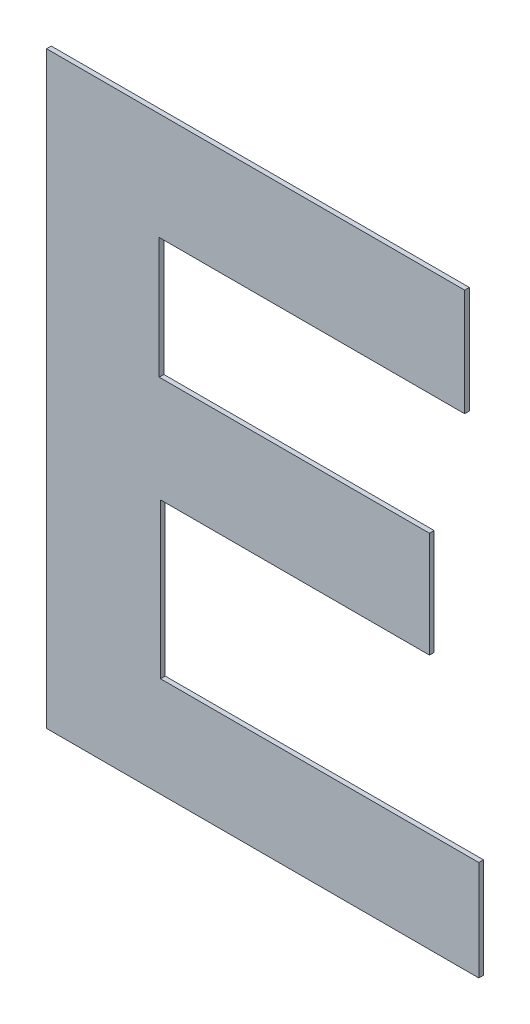
ISO-10303-21;
HEADER;
FILE_DESCRIPTION(('STEP AP214'),'2;1');
FILE_NAME('part.step','',(''),(''),'','','');
FILE_SCHEMA(('AUTOMOTIVE_DESIGN { 1 0 10303 214 1 1 1 1 }'));
ENDSEC;
DATA;
#1=APPLICATION_CONTEXT('core data for automotive mechanical design processes');
#2=APPLICATION_PROTOCOL_DEFINITION('international standard','automotive_design',2000,#1);
#3=PRODUCT_CONTEXT('',#1,'mechanical');
#4=PRODUCT('Part','Part','',(#3));
#5=PRODUCT_RELATED_PRODUCT_CATEGORY('part','',(#4));
#6=PRODUCT_DEFINITION_FORMATION('','',#4);
#7=PRODUCT_DEFINITION_CONTEXT('part definition',#1,'design');
#8=PRODUCT_DEFINITION('design','',#6,#7);
#9=PRODUCT_DEFINITION_SHAPE('','',#8);
#10=(LENGTH_UNIT() NAMED_UNIT(*) SI_UNIT(.MILLI.,.METRE.));
#11=(NAMED_UNIT(*) PLANE_ANGLE_UNIT() SI_UNIT($,.RADIAN.));
#12=(NAMED_UNIT(*) SI_UNIT($,.STERADIAN.) SOLID_ANGLE_UNIT());
#13=UNCERTAINTY_MEASURE_WITH_UNIT(LENGTH_MEASURE(1.E-05),#10,'distance_accuracy_value','');
#14=(GEOMETRIC_REPRESENTATION_CONTEXT(3) GLOBAL_UNCERTAINTY_ASSIGNED_CONTEXT((#13)) GLOBAL_UNIT_ASSIGNED_CONTEXT((#10,
#11,#12)) REPRESENTATION_CONTEXT('',''));
#15=CARTESIAN_POINT('',(0.,0.,0.));
#16=DIRECTION('',(0.,0.,1.));
#17=DIRECTION('',(1.,0.,0.));
#18=AXIS2_PLACEMENT_3D('',#15,#16,#17);
#19=CARTESIAN_POINT('',(-0.2580326955261,-0.078781583834882,0.00086146168299));
#20=DIRECTION('',(-1.,0.,0.));
#21=DIRECTION('',(0.,0.,1.));
#22=AXIS2_PLACEMENT_3D('',#19,#20,#21);
#23=PLANE('',#22);
#24=DIRECTION('',(0.,0.,1.));
#25=VECTOR('',#24,1.);
#26=CARTESIAN_POINT('',(-0.2580326955261,-0.1544312260326,-0.00033853831701));
#27=LINE('',#26,#25);
#28=CARTESIAN_POINT('',(-0.2580326955261,-0.1544312260326,-0.00033853831701));
#29=VERTEX_POINT('',#28);
#30=CARTESIAN_POINT('',(-0.2580326955261,-0.1544312260326,0.00086146168299));
#31=VERTEX_POINT('',#30);
#32=EDGE_CURVE('E11',#29,#31,#27,.T.);
#33=ORIENTED_EDGE('',*,*,#32,.T.);
#34=DIRECTION('',(0.,1.,0.));
#35=VECTOR('',#34,1.);
#36=CARTESIAN_POINT('',(-0.2580326955261,-0.1544312260326,0.00086146168299));
#37=LINE('',#36,#35);
#38=CARTESIAN_POINT('',(-0.2580326955261,-0.00313194163716401,0.00086146168299));
#39=VERTEX_POINT('',#38);
#40=EDGE_CURVE('E24',#31,#39,#37,.T.);
#41=ORIENTED_EDGE('',*,*,#40,.T.);
#42=DIRECTION('',(0.,0.,1.));
#43=VECTOR('',#42,1.);
#44=CARTESIAN_POINT('',(-0.2580326955261,-0.00313194163716401,-0.00033853831701));
#45=LINE('',#44,#43);
#46=CARTESIAN_POINT('',(-0.2580326955261,-0.00313194163716401,-0.00033853831701));
#47=VERTEX_POINT('',#46);
#48=EDGE_CURVE('E197',#47,#39,#45,.T.);
#49=ORIENTED_EDGE('',*,*,#48,.F.);
#50=DIRECTION('',(0.,1.,0.));
#51=VECTOR('',#50,1.);
#52=CARTESIAN_POINT('',(-0.2580326955261,-0.1544312260326,-0.00033853831701));
#53=LINE('',#52,#51);
#54=EDGE_CURVE('E195',#29,#47,#53,.T.);
#55=ORIENTED_EDGE('',*,*,#54,.F.);
#56=EDGE_LOOP('',(#33,#41,#49,#55));
#57=FACE_BOUND('',#56,.T.);
#58=ADVANCED_FACE('F17',(#57),#23,.T.);
#59=CARTESIAN_POINT('',(-0.2042939733141,-0.00313194163716401,0.00086146168299));
#60=DIRECTION('',(0.,1.,0.));
#61=DIRECTION('',(0.,0.,1.));
#62=AXIS2_PLACEMENT_3D('',#59,#60,#61);
#63=PLANE('',#62);
#64=ORIENTED_EDGE('',*,*,#48,.T.);
#65=DIRECTION('',(1.,0.,0.));
#66=VECTOR('',#65,1.);
#67=CARTESIAN_POINT('',(-0.2580326955261,-0.00313194163716401,0.00086146168299));
#68=LINE('',#67,#66);
#69=CARTESIAN_POINT('',(-0.1505552511021,-0.00313194163716401,0.00086146168299));
#70=VERTEX_POINT('',#69);
#71=EDGE_CURVE('E193',#39,#70,#68,.T.);
#72=ORIENTED_EDGE('',*,*,#71,.T.);
#73=DIRECTION('',(0.,0.,1.));
#74=VECTOR('',#73,1.);
#75=CARTESIAN_POINT('',(-0.1505552511021,-0.00313194163716401,-0.00033853831701));
#76=LINE('',#75,#74);
#77=CARTESIAN_POINT('',(-0.1505552511021,-0.00313194163716401,-0.00033853831701));
#78=VERTEX_POINT('',#77);
#79=EDGE_CURVE('E190',#78,#70,#76,.T.);
#80=ORIENTED_EDGE('',*,*,#79,.F.);
#81=DIRECTION('',(1.,0.,0.));
#82=VECTOR('',#81,1.);
#83=CARTESIAN_POINT('',(-0.2580326955261,-0.00313194163716401,-0.00033853831701));
#84=LINE('',#83,#82);
#85=EDGE_CURVE('E187',#47,#78,#84,.T.);
#86=ORIENTED_EDGE('',*,*,#85,.F.);
#87=EDGE_LOOP('',(#64,#72,#80,#86));
#88=FACE_BOUND('',#87,.T.);
#89=ADVANCED_FACE('F203',(#88),#63,.T.);
#90=CARTESIAN_POINT('',(-0.1505552511021,-0.016894632137542,0.00086146168299));
#91=DIRECTION('',(1.,0.,0.));
#92=DIRECTION('',(0.,0.,-1.));
#93=AXIS2_PLACEMENT_3D('',#90,#91,#92);
#94=PLANE('',#93);
#95=ORIENTED_EDGE('',*,*,#79,.T.);
#96=DIRECTION('',(0.,-1.,0.));
#97=VECTOR('',#96,1.);
#98=CARTESIAN_POINT('',(-0.1505552511021,-0.00313194163716401,0.00086146168299));
#99=LINE('',#98,#97);
#100=CARTESIAN_POINT('',(-0.1505552511021,-0.03065732263792,0.00086146168299));
#101=VERTEX_POINT('',#100);
#102=EDGE_CURVE('E185',#70,#101,#99,.T.);
#103=ORIENTED_EDGE('',*,*,#102,.T.);
#104=DIRECTION('',(0.,0.,1.));
#105=VECTOR('',#104,1.);
#106=CARTESIAN_POINT('',(-0.1505552511021,-0.03065732263792,-0.00033853831701));
#107=LINE('',#106,#105);
#108=CARTESIAN_POINT('',(-0.1505552511021,-0.03065732263792,-0.00033853831701));
#109=VERTEX_POINT('',#108);
#110=EDGE_CURVE('E182',#109,#101,#107,.T.);
#111=ORIENTED_EDGE('',*,*,#110,.F.);
#112=DIRECTION('',(0.,-1.,0.));
#113=VECTOR('',#112,1.);
#114=CARTESIAN_POINT('',(-0.1505552511021,-0.00313194163716401,-0.00033853831701));
#115=LINE('',#114,#113);
#116=EDGE_CURVE('E179',#78,#109,#115,.T.);
#117=ORIENTED_EDGE('',*,*,#116,.F.);
#118=EDGE_LOOP('',(#95,#103,#111,#117));
#119=FACE_BOUND('',#118,.T.);
#120=ADVANCED_FACE('F209',(#119),#94,.T.);
#121=CARTESIAN_POINT('',(-0.1898152963427,-0.03065732263792,0.00086146168299));
#122=DIRECTION('',(0.,-1.,0.));
#123=DIRECTION('',(0.,0.,-1.));
#124=AXIS2_PLACEMENT_3D('',#121,#122,#123);
#125=PLANE('',#124);
#126=ORIENTED_EDGE('',*,*,#110,.T.);
#127=DIRECTION('',(-1.,0.,0.));
#128=VECTOR('',#127,1.);
#129=CARTESIAN_POINT('',(-0.1505552511021,-0.03065732263792,0.00086146168299));
#130=LINE('',#129,#128);
#131=CARTESIAN_POINT('',(-0.2290753415833,-0.03065732263792,0.00086146168299));
#132=VERTEX_POINT('',#131);
#133=EDGE_CURVE('E177',#101,#132,#130,.T.);
#134=ORIENTED_EDGE('',*,*,#133,.T.);
#135=DIRECTION('',(0.,0.,1.));
#136=VECTOR('',#135,1.);
#137=CARTESIAN_POINT('',(-0.2290753415833,-0.03065732263792,-0.00033853831701));
#138=LINE('',#137,#136);
#139=CARTESIAN_POINT('',(-0.2290753415833,-0.03065732263792,-0.00033853831701));
#140=VERTEX_POINT('',#139);
#141=EDGE_CURVE('E174',#140,#132,#138,.T.);
#142=ORIENTED_EDGE('',*,*,#141,.F.);
#143=DIRECTION('',(-1.,0.,0.));
#144=VECTOR('',#143,1.);
#145=CARTESIAN_POINT('',(-0.1505552511021,-0.03065732263792,-0.00033853831701));
#146=LINE('',#145,#144);
#147=EDGE_CURVE('E171',#109,#140,#146,.T.);
#148=ORIENTED_EDGE('',*,*,#147,.F.);
#149=EDGE_LOOP('',(#126,#134,#142,#148));
#150=FACE_BOUND('',#149,.T.);
#151=ADVANCED_FACE('F213',(#150),#125,.T.);
#152=CARTESIAN_POINT('',(-0.2290753415833,-0.04621178553786,0.00086146168299));
#153=DIRECTION('',(1.,0.,0.));
#154=DIRECTION('',(0.,0.,-1.));
#155=AXIS2_PLACEMENT_3D('',#152,#153,#154);
#156=PLANE('',#155);
#157=ORIENTED_EDGE('',*,*,#141,.T.);
#158=DIRECTION('',(0.,-1.,0.));
#159=VECTOR('',#158,1.);
#160=CARTESIAN_POINT('',(-0.2290753415833,-0.03065732263792,0.00086146168299));
#161=LINE('',#160,#159);
#162=CARTESIAN_POINT('',(-0.2290753415833,-0.0617662484378,0.00086146168299));
#163=VERTEX_POINT('',#162);
#164=EDGE_CURVE('E169',#132,#163,#161,.T.);
#165=ORIENTED_EDGE('',*,*,#164,.T.);
#166=DIRECTION('',(0.,0.,1.));
#167=VECTOR('',#166,1.);
#168=CARTESIAN_POINT('',(-0.2290753415833,-0.0617662484378,-0.00033853831701));
#169=LINE('',#168,#167);
#170=CARTESIAN_POINT('',(-0.2290753415833,-0.0617662484378,-0.00033853831701));
#171=VERTEX_POINT('',#170);
#172=EDGE_CURVE('E166',#171,#163,#169,.T.);
#173=ORIENTED_EDGE('',*,*,#172,.F.);
#174=DIRECTION('',(0.,-1.,0.));
#175=VECTOR('',#174,1.);
#176=CARTESIAN_POINT('',(-0.2290753415833,-0.03065732263792,-0.00033853831701));
#177=LINE('',#176,#175);
#178=EDGE_CURVE('E163',#140,#171,#177,.T.);
#179=ORIENTED_EDGE('',*,*,#178,.F.);
#180=EDGE_LOOP('',(#157,#165,#173,#179));
#181=FACE_BOUND('',#180,.T.);
#182=ADVANCED_FACE('F217',(#181),#156,.T.);
#183=CARTESIAN_POINT('',(-0.1943380766739,-0.0617662484378,0.00086146168299));
#184=DIRECTION('',(0.,1.,0.));
#185=DIRECTION('',(0.,0.,1.));
#186=AXIS2_PLACEMENT_3D('',#183,#184,#185);
#187=PLANE('',#186);
#188=ORIENTED_EDGE('',*,*,#172,.T.);
#189=DIRECTION('',(1.,0.,0.));
#190=VECTOR('',#189,1.);
#191=CARTESIAN_POINT('',(-0.2290753415833,-0.0617662484378,0.00086146168299));
#192=LINE('',#191,#190);
#193=CARTESIAN_POINT('',(-0.1596008117645,-0.0617662484378,0.00086146168299));
#194=VERTEX_POINT('',#193);
#195=EDGE_CURVE('E161',#163,#194,#192,.T.);
#196=ORIENTED_EDGE('',*,*,#195,.T.);
#197=DIRECTION('',(0.,0.,1.));
#198=VECTOR('',#197,1.);
#199=CARTESIAN_POINT('',(-0.1596008117645,-0.0617662484378,-0.00033853831701));
#200=LINE('',#199,#198);
#201=CARTESIAN_POINT('',(-0.1596008117645,-0.0617662484378,-0.00033853831701));
#202=VERTEX_POINT('',#201);
#203=EDGE_CURVE('E158',#202,#194,#200,.T.);
#204=ORIENTED_EDGE('',*,*,#203,.F.);
#205=DIRECTION('',(1.,0.,0.));
#206=VECTOR('',#205,1.);
#207=CARTESIAN_POINT('',(-0.2290753415833,-0.0617662484378,-0.00033853831701));
#208=LINE('',#207,#206);
#209=EDGE_CURVE('E155',#171,#202,#208,.T.);
#210=ORIENTED_EDGE('',*,*,#209,.F.);
#211=EDGE_LOOP('',(#188,#196,#204,#210));
#212=FACE_BOUND('',#211,.T.);
#213=ADVANCED_FACE('F220',(#212),#187,.T.);
#214=CARTESIAN_POINT('',(-0.1596008117645,-0.075337118143,0.00086146168299));
#215=DIRECTION('',(1.,0.,0.));
#216=DIRECTION('',(0.,0.,-1.));
#217=AXIS2_PLACEMENT_3D('',#214,#215,#216);
#218=PLANE('',#217);
#219=ORIENTED_EDGE('',*,*,#203,.T.);
#220=DIRECTION('',(0.,-1.,0.));
#221=VECTOR('',#220,1.);
#222=CARTESIAN_POINT('',(-0.1596008117645,-0.0617662484378,0.00086146168299));
#223=LINE('',#222,#221);
#224=CARTESIAN_POINT('',(-0.1596008117645,-0.0889079878482,0.00086146168299));
#225=VERTEX_POINT('',#224);
#226=EDGE_CURVE('E153',#194,#225,#223,.T.);
#227=ORIENTED_EDGE('',*,*,#226,.T.);
#228=DIRECTION('',(0.,0.,1.));
#229=VECTOR('',#228,1.);
#230=CARTESIAN_POINT('',(-0.1596008117645,-0.0889079878482,-0.00033853831701));
#231=LINE('',#230,#229);
#232=CARTESIAN_POINT('',(-0.1596008117645,-0.0889079878482,-0.00033853831701));
#233=VERTEX_POINT('',#232);
#234=EDGE_CURVE('E150',#233,#225,#231,.T.);
#235=ORIENTED_EDGE('',*,*,#234,.F.);
#236=DIRECTION('',(0.,-1.,0.));
#237=VECTOR('',#236,1.);
#238=CARTESIAN_POINT('',(-0.1596008117645,-0.0617662484378,-0.00033853831701));
#239=LINE('',#238,#237);
#240=EDGE_CURVE('E147',#202,#233,#239,.T.);
#241=ORIENTED_EDGE('',*,*,#240,.F.);
#242=EDGE_LOOP('',(#219,#227,#235,#241));
#243=FACE_BOUND('',#242,.T.);
#244=ADVANCED_FACE('F225',(#243),#218,.T.);
#245=CARTESIAN_POINT('',(-0.1941646793449,-0.0889079878482,0.00086146168299));
#246=DIRECTION('',(0.,-1.,0.));
#247=DIRECTION('',(0.,0.,-1.));
#248=AXIS2_PLACEMENT_3D('',#245,#246,#247);
#249=PLANE('',#248);
#250=ORIENTED_EDGE('',*,*,#234,.T.);
#251=DIRECTION('',(-1.,0.,0.));
#252=VECTOR('',#251,1.);
#253=CARTESIAN_POINT('',(-0.1596008117645,-0.0889079878482,0.00086146168299));
#254=LINE('',#253,#252);
#255=CARTESIAN_POINT('',(-0.2287285469253,-0.0889079878482,0.00086146168299));
#256=VERTEX_POINT('',#255);
#257=EDGE_CURVE('E145',#225,#256,#254,.T.);
#258=ORIENTED_EDGE('',*,*,#257,.T.);
#259=DIRECTION('',(0.,0.,1.));
#260=VECTOR('',#259,1.);
#261=CARTESIAN_POINT('',(-0.2287285469253,-0.0889079878482,-0.00033853831701));
#262=LINE('',#261,#260);
#263=CARTESIAN_POINT('',(-0.2287285469253,-0.0889079878482,-0.00033853831701));
#264=VERTEX_POINT('',#263);
#265=EDGE_CURVE('E142',#264,#256,#262,.T.);
#266=ORIENTED_EDGE('',*,*,#265,.F.);
#267=DIRECTION('',(-1.,0.,0.));
#268=VECTOR('',#267,1.);
#269=CARTESIAN_POINT('',(-0.1596008117645,-0.0889079878482,-0.00033853831701));
#270=LINE('',#269,#268);
#271=EDGE_CURVE('E139',#233,#264,#270,.T.);
#272=ORIENTED_EDGE('',*,*,#271,.F.);
#273=EDGE_LOOP('',(#250,#258,#266,#272));
#274=FACE_BOUND('',#273,.T.);
#275=ADVANCED_FACE('F229',(#274),#249,.T.);
#276=CARTESIAN_POINT('',(-0.2287285469253,-0.1088172524172,0.00086146168299));
#277=DIRECTION('',(1.,0.,0.));
#278=DIRECTION('',(0.,0.,-1.));
#279=AXIS2_PLACEMENT_3D('',#276,#277,#278);
#280=PLANE('',#279);
#281=ORIENTED_EDGE('',*,*,#265,.T.);
#282=DIRECTION('',(0.,-1.,0.));
#283=VECTOR('',#282,1.);
#284=CARTESIAN_POINT('',(-0.2287285469253,-0.0889079878482,0.00086146168299));
#285=LINE('',#284,#283);
#286=CARTESIAN_POINT('',(-0.2287285469253,-0.1287265169862,0.00086146168299));
#287=VERTEX_POINT('',#286);
#288=EDGE_CURVE('E137',#256,#287,#285,.T.);
#289=ORIENTED_EDGE('',*,*,#288,.T.);
#290=DIRECTION('',(0.,0.,1.));
#291=VECTOR('',#290,1.);
#292=CARTESIAN_POINT('',(-0.2287285469253,-0.1287265169862,-0.00033853831701));
#293=LINE('',#292,#291);
#294=CARTESIAN_POINT('',(-0.2287285469253,-0.1287265169862,-0.00033853831701));
#295=VERTEX_POINT('',#294);
#296=EDGE_CURVE('E134',#295,#287,#293,.T.);
#297=ORIENTED_EDGE('',*,*,#296,.F.);
#298=DIRECTION('',(0.,-1.,0.));
#299=VECTOR('',#298,1.);
#300=CARTESIAN_POINT('',(-0.2287285469253,-0.0889079878482,-0.00033853831701));
#301=LINE('',#300,#299);
#302=EDGE_CURVE('E132',#264,#295,#301,.T.);
#303=ORIENTED_EDGE('',*,*,#302,.F.);
#304=EDGE_LOOP('',(#281,#289,#297,#303));
#305=FACE_BOUND('',#304,.T.);
#306=ADVANCED_FACE('F232',(#305),#280,.T.);
#307=CARTESIAN_POINT('',(-0.1878248395035,-0.1287265169862,0.00086146168299));
#308=DIRECTION('',(0.,1.,0.));
#309=DIRECTION('',(0.,0.,1.));
#310=AXIS2_PLACEMENT_3D('',#307,#308,#309);
#311=PLANE('',#310);
#312=ORIENTED_EDGE('',*,*,#296,.T.);
#313=DIRECTION('',(1.,0.,0.));
#314=VECTOR('',#313,1.);
#315=CARTESIAN_POINT('',(-0.2287285469253,-0.1287265169862,0.00086146168299));
#316=LINE('',#315,#314);
#317=CARTESIAN_POINT('',(-0.1469211320817,-0.1287265169862,0.00086146168299));
#318=VERTEX_POINT('',#317);
#319=EDGE_CURVE('E130',#287,#318,#316,.T.);
#320=ORIENTED_EDGE('',*,*,#319,.T.);
#321=DIRECTION('',(0.,0.,1.));
#322=VECTOR('',#321,1.);
#323=CARTESIAN_POINT('',(-0.1469211320817,-0.1287265169862,-0.00033853831701));
#324=LINE('',#323,#322);
#325=CARTESIAN_POINT('',(-0.1469211320817,-0.1287265169862,-0.00033853831701));
#326=VERTEX_POINT('',#325);
#327=EDGE_CURVE('E128',#326,#318,#324,.T.);
#328=ORIENTED_EDGE('',*,*,#327,.F.);
#329=DIRECTION('',(1.,0.,0.));
#330=VECTOR('',#329,1.);
#331=CARTESIAN_POINT('',(-0.2287285469253,-0.1287265169862,-0.00033853831701));
#332=LINE('',#331,#330);
#333=EDGE_CURVE('E119',#295,#326,#332,.T.);
#334=ORIENTED_EDGE('',*,*,#333,.F.);
#335=EDGE_LOOP('',(#312,#320,#328,#334));
#336=FACE_BOUND('',#335,.T.);
#337=ADVANCED_FACE('F235',(#336),#311,.T.);
#338=CARTESIAN_POINT('',(-0.1469211320817,-0.1415788715094,0.00086146168299));
#339=DIRECTION('',(1.,0.,0.));
#340=DIRECTION('',(0.,0.,-1.));
#341=AXIS2_PLACEMENT_3D('',#338,#339,#340);
#342=PLANE('',#341);
#343=ORIENTED_EDGE('',*,*,#327,.T.);
#344=DIRECTION('',(0.,-1.,0.));
#345=VECTOR('',#344,1.);
#346=CARTESIAN_POINT('',(-0.1469211320817,-0.1287265169862,0.00086146168299));
#347=LINE('',#346,#345);
#348=CARTESIAN_POINT('',(-0.1469211320817,-0.1544312260326,0.00086146168299));
#349=VERTEX_POINT('',#348);
#350=EDGE_CURVE('E108',#318,#349,#347,.T.);
#351=ORIENTED_EDGE('',*,*,#350,.T.);
#352=DIRECTION('',(0.,0.,1.));
#353=VECTOR('',#352,1.);
#354=CARTESIAN_POINT('',(-0.1469211320817,-0.1544312260326,-0.00033853831701));
#355=LINE('',#354,#353);
#356=CARTESIAN_POINT('',(-0.1469211320817,-0.1544312260326,-0.00033853831701));
#357=VERTEX_POINT('',#356);
#358=EDGE_CURVE('E102',#357,#349,#355,.T.);
#359=ORIENTED_EDGE('',*,*,#358,.F.);
#360=DIRECTION('',(0.,-1.,0.));
#361=VECTOR('',#360,1.);
#362=CARTESIAN_POINT('',(-0.1469211320817,-0.1287265169862,-0.00033853831701));
#363=LINE('',#362,#361);
#364=EDGE_CURVE('E106',#326,#357,#363,.T.);
#365=ORIENTED_EDGE('',*,*,#364,.F.);
#366=EDGE_LOOP('',(#343,#351,#359,#365));
#367=FACE_BOUND('',#366,.T.);
#368=ADVANCED_FACE('F105',(#367),#342,.T.);
#369=CARTESIAN_POINT('',(-0.2024769138039,-0.1544312260326,0.00086146168299));
#370=DIRECTION('',(0.,-1.,0.));
#371=DIRECTION('',(0.,0.,-1.));
#372=AXIS2_PLACEMENT_3D('',#369,#370,#371);
#373=PLANE('',#372);
#374=ORIENTED_EDGE('',*,*,#358,.T.);
#375=DIRECTION('',(-1.,0.,0.));
#376=VECTOR('',#375,1.);
#377=CARTESIAN_POINT('',(-0.1469211320817,-0.1544312260326,0.00086146168299));
#378=LINE('',#377,#376);
#379=EDGE_CURVE('E120',#349,#31,#378,.T.);
#380=ORIENTED_EDGE('',*,*,#379,.T.);
#381=ORIENTED_EDGE('',*,*,#32,.F.);
#382=DIRECTION('',(-1.,0.,0.));
#383=VECTOR('',#382,1.);
#384=CARTESIAN_POINT('',(-0.1469211320817,-0.1544312260326,-0.00033853831701));
#385=LINE('',#384,#383);
#386=EDGE_CURVE('E116',#357,#29,#385,.T.);
#387=ORIENTED_EDGE('',*,*,#386,.F.);
#388=EDGE_LOOP('',(#374,#380,#381,#387));
#389=FACE_BOUND('',#388,.T.);
#390=ADVANCED_FACE('F122',(#389),#373,.T.);
#391=CARTESIAN_POINT('',(-0.2024769138039,-0.1544312260326,-0.00033853831701));
#392=DIRECTION('',(0.,0.,1.));
#393=DIRECTION('',(1.,0.,0.));
#394=AXIS2_PLACEMENT_3D('',#391,#392,#393);
#395=PLANE('',#394);
#396=ORIENTED_EDGE('',*,*,#54,.T.);
#397=ORIENTED_EDGE('',*,*,#85,.T.);
#398=ORIENTED_EDGE('',*,*,#116,.T.);
#399=ORIENTED_EDGE('',*,*,#147,.T.);
#400=ORIENTED_EDGE('',*,*,#178,.T.);
#401=ORIENTED_EDGE('',*,*,#209,.T.);
#402=ORIENTED_EDGE('',*,*,#240,.T.);
#403=ORIENTED_EDGE('',*,*,#271,.T.);
#404=ORIENTED_EDGE('',*,*,#302,.T.);
#405=ORIENTED_EDGE('',*,*,#333,.T.);
#406=ORIENTED_EDGE('',*,*,#364,.T.);
#407=ORIENTED_EDGE('',*,*,#386,.T.);
#408=EDGE_LOOP('',(#396,#397,#398,#399,#400,#401,#402,#403,#404,#405,#406,#407));
#409=FACE_BOUND('',#408,.T.);
#410=ADVANCED_FACE('F115',(#409),#395,.F.);
#411=CARTESIAN_POINT('',(-0.2024769138039,-0.1544312260326,0.00086146168299));
#412=DIRECTION('',(0.,0.,1.));
#413=DIRECTION('',(1.,0.,0.));
#414=AXIS2_PLACEMENT_3D('',#411,#412,#413);
#415=PLANE('',#414);
#416=ORIENTED_EDGE('',*,*,#40,.F.);
#417=ORIENTED_EDGE('',*,*,#379,.F.);
#418=ORIENTED_EDGE('',*,*,#350,.F.);
#419=ORIENTED_EDGE('',*,*,#319,.F.);
#420=ORIENTED_EDGE('',*,*,#288,.F.);
#421=ORIENTED_EDGE('',*,*,#257,.F.);
#422=ORIENTED_EDGE('',*,*,#226,.F.);
#423=ORIENTED_EDGE('',*,*,#195,.F.);
#424=ORIENTED_EDGE('',*,*,#164,.F.);
#425=ORIENTED_EDGE('',*,*,#133,.F.);
#426=ORIENTED_EDGE('',*,*,#102,.F.);
#427=ORIENTED_EDGE('',*,*,#71,.F.);
#428=EDGE_LOOP('',(#416,#417,#418,#419,#420,#421,#422,#423,#424,#425,#426,#427));
#429=FACE_BOUND('',#428,.T.);
#430=ADVANCED_FACE('F205',(#429),#415,.T.);
#431=CLOSED_SHELL('',(#58,#89,#120,#151,#182,#213,#244,#275,#306,#337,#368,#390,#410,#430));
#432=MANIFOLD_SOLID_BREP('B1',#431);
#433=ADVANCED_BREP_SHAPE_REPRESENTATION('',(#18,#432),#14);
#434=SHAPE_DEFINITION_REPRESENTATION(#9,#433);
ENDSEC;
END-ISO-10303-21;
